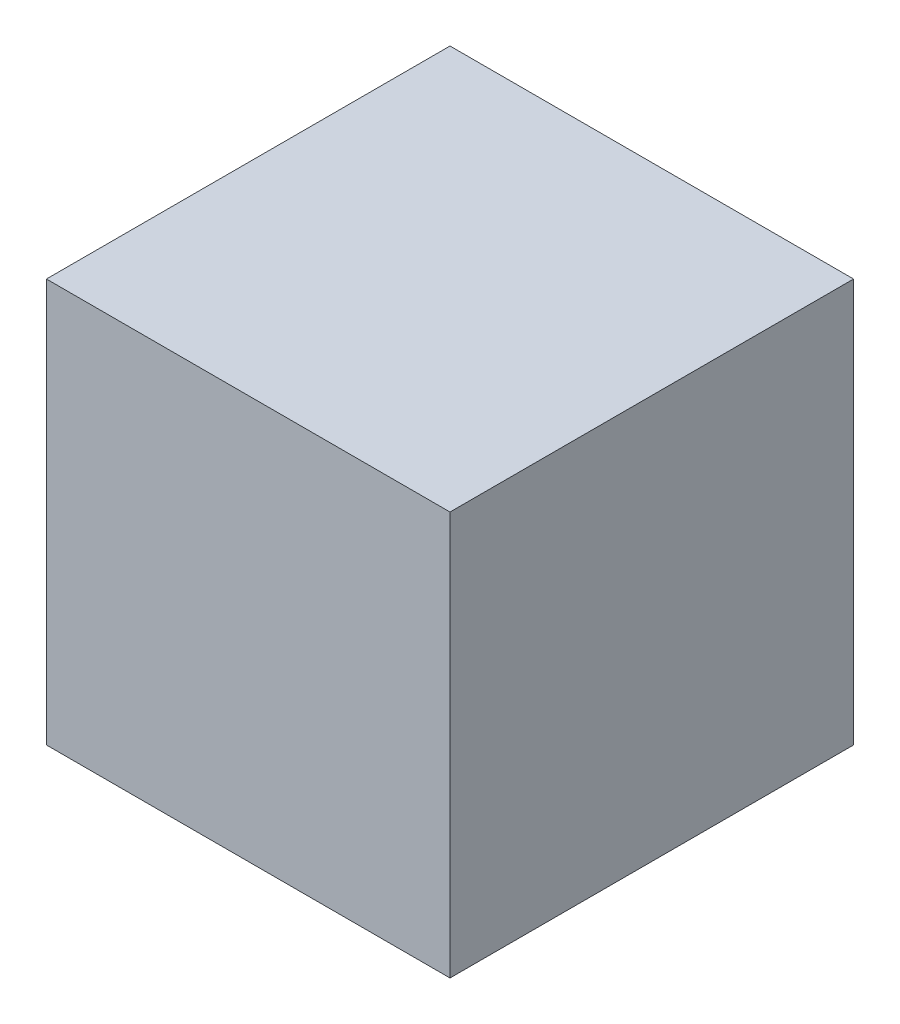
ISO-10303-21;
HEADER;
FILE_DESCRIPTION(('STEP AP214'),'2;1');
FILE_NAME('part.step','',(''),(''),'','','');
FILE_SCHEMA(('AUTOMOTIVE_DESIGN { 1 0 10303 214 1 1 1 1 }'));
ENDSEC;
DATA;
#1=APPLICATION_CONTEXT('core data for automotive mechanical design processes');
#2=APPLICATION_PROTOCOL_DEFINITION('international standard','automotive_design',2000,#1);
#3=PRODUCT_CONTEXT('',#1,'mechanical');
#4=PRODUCT('Part','Part','',(#3));
#5=PRODUCT_RELATED_PRODUCT_CATEGORY('part','',(#4));
#6=PRODUCT_DEFINITION_FORMATION('','',#4);
#7=PRODUCT_DEFINITION_CONTEXT('part definition',#1,'design');
#8=PRODUCT_DEFINITION('design','',#6,#7);
#9=PRODUCT_DEFINITION_SHAPE('','',#8);
#10=(LENGTH_UNIT() NAMED_UNIT(*) SI_UNIT(.MILLI.,.METRE.));
#11=(NAMED_UNIT(*) PLANE_ANGLE_UNIT() SI_UNIT($,.RADIAN.));
#12=(NAMED_UNIT(*) SI_UNIT($,.STERADIAN.) SOLID_ANGLE_UNIT());
#13=UNCERTAINTY_MEASURE_WITH_UNIT(LENGTH_MEASURE(1.E-05),#10,'distance_accuracy_value','');
#14=(GEOMETRIC_REPRESENTATION_CONTEXT(3) GLOBAL_UNCERTAINTY_ASSIGNED_CONTEXT((#13)) GLOBAL_UNIT_ASSIGNED_CONTEXT((#10,
#11,#12)) REPRESENTATION_CONTEXT('',''));
#15=CARTESIAN_POINT('',(0.,0.,0.));
#16=DIRECTION('',(0.,0.,1.));
#17=DIRECTION('',(1.,0.,0.));
#18=AXIS2_PLACEMENT_3D('',#15,#16,#17);
#19=CARTESIAN_POINT('',(-1.738260948108,2.046329517008,0.01424564597947));
#20=DIRECTION('',(0.,1.,0.));
#21=DIRECTION('',(0.,0.,1.));
#22=AXIS2_PLACEMENT_3D('',#19,#20,#21);
#23=PLANE('',#22);
#24=DIRECTION('',(0.,0.,-1.));
#25=VECTOR('',#24,1.);
#26=CARTESIAN_POINT('',(-1.738260948108,2.046329517008,2.07327518838773));
#27=LINE('',#26,#25);
#28=CARTESIAN_POINT('',(-1.738260948108,2.046329517008,4.132304730796));
#29=VERTEX_POINT('',#28);
#30=CARTESIAN_POINT('',(-1.738260948108,2.046329517008,0.01424564597947));
#31=VERTEX_POINT('',#30);
#32=EDGE_CURVE('E77',#29,#31,#27,.T.);
#33=ORIENTED_EDGE('',*,*,#32,.F.);
#34=DIRECTION('',(-1.,0.,0.));
#35=VECTOR('',#34,1.);
#36=CARTESIAN_POINT('',(0.3207685943005,2.046329517008,4.132304730796));
#37=LINE('',#36,#35);
#38=CARTESIAN_POINT('',(2.379798136709,2.046329517008,4.132304730796));
#39=VERTEX_POINT('',#38);
#40=EDGE_CURVE('E59',#39,#29,#37,.T.);
#41=ORIENTED_EDGE('',*,*,#40,.F.);
#42=DIRECTION('',(0.,0.,-1.));
#43=VECTOR('',#42,1.);
#44=CARTESIAN_POINT('',(2.379798136709,2.046329517008,2.07327518838773));
#45=LINE('',#44,#43);
#46=CARTESIAN_POINT('',(2.379798136709,2.046329517008,0.01424564597947));
#47=VERTEX_POINT('',#46);
#48=EDGE_CURVE('E21',#39,#47,#45,.T.);
#49=ORIENTED_EDGE('',*,*,#48,.T.);
#50=DIRECTION('',(-1.,0.,0.));
#51=VECTOR('',#50,1.);
#52=CARTESIAN_POINT('',(0.3207685943005,2.046329517008,0.01424564597947));
#53=LINE('',#52,#51);
#54=EDGE_CURVE('E56',#47,#31,#53,.T.);
#55=ORIENTED_EDGE('',*,*,#54,.T.);
#56=EDGE_LOOP('',(#33,#41,#49,#55));
#57=FACE_BOUND('',#56,.T.);
#58=ADVANCED_FACE('F17',(#57),#23,.T.);
#59=CARTESIAN_POINT('',(2.379798136709,-2.071729567808,0.01424564597947));
#60=DIRECTION('',(-1.,0.,0.));
#61=DIRECTION('',(0.,0.,1.));
#62=AXIS2_PLACEMENT_3D('',#59,#60,#61);
#63=PLANE('',#62);
#64=DIRECTION('',(0.,1.,0.));
#65=VECTOR('',#64,1.);
#66=CARTESIAN_POINT('',(2.379798136709,-0.0127000254000001,4.132304730796));
#67=LINE('',#66,#65);
#68=CARTESIAN_POINT('',(2.379798136709,-2.071729567808,4.132304730796));
#69=VERTEX_POINT('',#68);
#70=EDGE_CURVE('E79',#69,#39,#67,.T.);
#71=ORIENTED_EDGE('',*,*,#70,.F.);
#72=DIRECTION('',(0.,0.,-1.));
#73=VECTOR('',#72,1.);
#74=CARTESIAN_POINT('',(2.379798136709,-2.071729567808,2.07327518838773));
#75=LINE('',#74,#73);
#76=CARTESIAN_POINT('',(2.379798136709,-2.071729567808,0.01424564597947));
#77=VERTEX_POINT('',#76);
#78=EDGE_CURVE('E74',#69,#77,#75,.T.);
#79=ORIENTED_EDGE('',*,*,#78,.T.);
#80=DIRECTION('',(0.,1.,0.));
#81=VECTOR('',#80,1.);
#82=CARTESIAN_POINT('',(2.379798136709,-0.0127000254000001,0.01424564597947));
#83=LINE('',#82,#81);
#84=EDGE_CURVE('E64',#77,#47,#83,.T.);
#85=ORIENTED_EDGE('',*,*,#84,.T.);
#86=ORIENTED_EDGE('',*,*,#48,.F.);
#87=EDGE_LOOP('',(#71,#79,#85,#86));
#88=FACE_BOUND('',#87,.T.);
#89=ADVANCED_FACE('F73',(#88),#63,.F.);
#90=CARTESIAN_POINT('',(2.379798136709,-2.071729567808,0.01424564597947));
#91=DIRECTION('',(0.,0.,1.));
#92=DIRECTION('',(0.,1.,0.));
#93=AXIS2_PLACEMENT_3D('',#90,#91,#92);
#94=PLANE('',#93);
#95=ORIENTED_EDGE('',*,*,#54,.F.);
#96=ORIENTED_EDGE('',*,*,#84,.F.);
#97=DIRECTION('',(-1.,0.,0.));
#98=VECTOR('',#97,1.);
#99=CARTESIAN_POINT('',(0.3207685943005,-2.071729567808,0.01424564597947));
#100=LINE('',#99,#98);
#101=CARTESIAN_POINT('',(-1.738260948108,-2.071729567808,0.01424564597947));
#102=VERTEX_POINT('',#101);
#103=EDGE_CURVE('E84',#77,#102,#100,.T.);
#104=ORIENTED_EDGE('',*,*,#103,.T.);
#105=DIRECTION('',(0.,-1.,0.));
#106=VECTOR('',#105,1.);
#107=CARTESIAN_POINT('',(-1.738260948108,-0.0127000254000001,0.01424564597947));
#108=LINE('',#107,#106);
#109=EDGE_CURVE('E70',#31,#102,#108,.T.);
#110=ORIENTED_EDGE('',*,*,#109,.F.);
#111=EDGE_LOOP('',(#95,#96,#104,#110));
#112=FACE_BOUND('',#111,.T.);
#113=ADVANCED_FACE('F67',(#112),#94,.F.);
#114=CARTESIAN_POINT('',(-1.738260948108,-2.071729567808,0.01424564597947));
#115=DIRECTION('',(-1.,0.,0.));
#116=DIRECTION('',(0.,0.,1.));
#117=AXIS2_PLACEMENT_3D('',#114,#115,#116);
#118=PLANE('',#117);
#119=DIRECTION('',(0.,-1.,0.));
#120=VECTOR('',#119,1.);
#121=CARTESIAN_POINT('',(-1.738260948108,-0.0127000254000001,4.132304730796));
#122=LINE('',#121,#120);
#123=CARTESIAN_POINT('',(-1.738260948108,-2.071729567808,4.132304730796));
#124=VERTEX_POINT('',#123);
#125=EDGE_CURVE('E35',#29,#124,#122,.T.);
#126=ORIENTED_EDGE('',*,*,#125,.F.);
#127=ORIENTED_EDGE('',*,*,#32,.T.);
#128=ORIENTED_EDGE('',*,*,#109,.T.);
#129=DIRECTION('',(0.,0.,1.));
#130=VECTOR('',#129,1.);
#131=CARTESIAN_POINT('',(-1.738260948108,-2.071729567808,2.07327518838773));
#132=LINE('',#131,#130);
#133=EDGE_CURVE('E27',#102,#124,#132,.T.);
#134=ORIENTED_EDGE('',*,*,#133,.T.);
#135=EDGE_LOOP('',(#126,#127,#128,#134));
#136=FACE_BOUND('',#135,.T.);
#137=ADVANCED_FACE('F89',(#136),#118,.T.);
#138=CARTESIAN_POINT('',(2.379798136709,-2.071729567808,4.132304730796));
#139=DIRECTION('',(0.,0.,1.));
#140=DIRECTION('',(0.,1.,0.));
#141=AXIS2_PLACEMENT_3D('',#138,#139,#140);
#142=PLANE('',#141);
#143=ORIENTED_EDGE('',*,*,#40,.T.);
#144=ORIENTED_EDGE('',*,*,#125,.T.);
#145=DIRECTION('',(1.,0.,0.));
#146=VECTOR('',#145,1.);
#147=CARTESIAN_POINT('',(0.3207685943005,-2.071729567808,4.132304730796));
#148=LINE('',#147,#146);
#149=EDGE_CURVE('E11',#124,#69,#148,.T.);
#150=ORIENTED_EDGE('',*,*,#149,.T.);
#151=ORIENTED_EDGE('',*,*,#70,.T.);
#152=EDGE_LOOP('',(#143,#144,#150,#151));
#153=FACE_BOUND('',#152,.T.);
#154=ADVANCED_FACE('F91',(#153),#142,.T.);
#155=CARTESIAN_POINT('',(-1.738260948108,-2.071729567808,0.01424564597947));
#156=DIRECTION('',(0.,1.,0.));
#157=DIRECTION('',(0.,0.,1.));
#158=AXIS2_PLACEMENT_3D('',#155,#156,#157);
#159=PLANE('',#158);
#160=ORIENTED_EDGE('',*,*,#133,.F.);
#161=ORIENTED_EDGE('',*,*,#103,.F.);
#162=ORIENTED_EDGE('',*,*,#78,.F.);
#163=ORIENTED_EDGE('',*,*,#149,.F.);
#164=EDGE_LOOP('',(#160,#161,#162,#163));
#165=FACE_BOUND('',#164,.T.);
#166=ADVANCED_FACE('F19',(#165),#159,.F.);
#167=CLOSED_SHELL('',(#58,#89,#113,#137,#154,#166));
#168=MANIFOLD_SOLID_BREP('B1',#167);
#169=ADVANCED_BREP_SHAPE_REPRESENTATION('',(#18,#168),#14);
#170=SHAPE_DEFINITION_REPRESENTATION(#9,#169);
ENDSEC;
END-ISO-10303-21;
